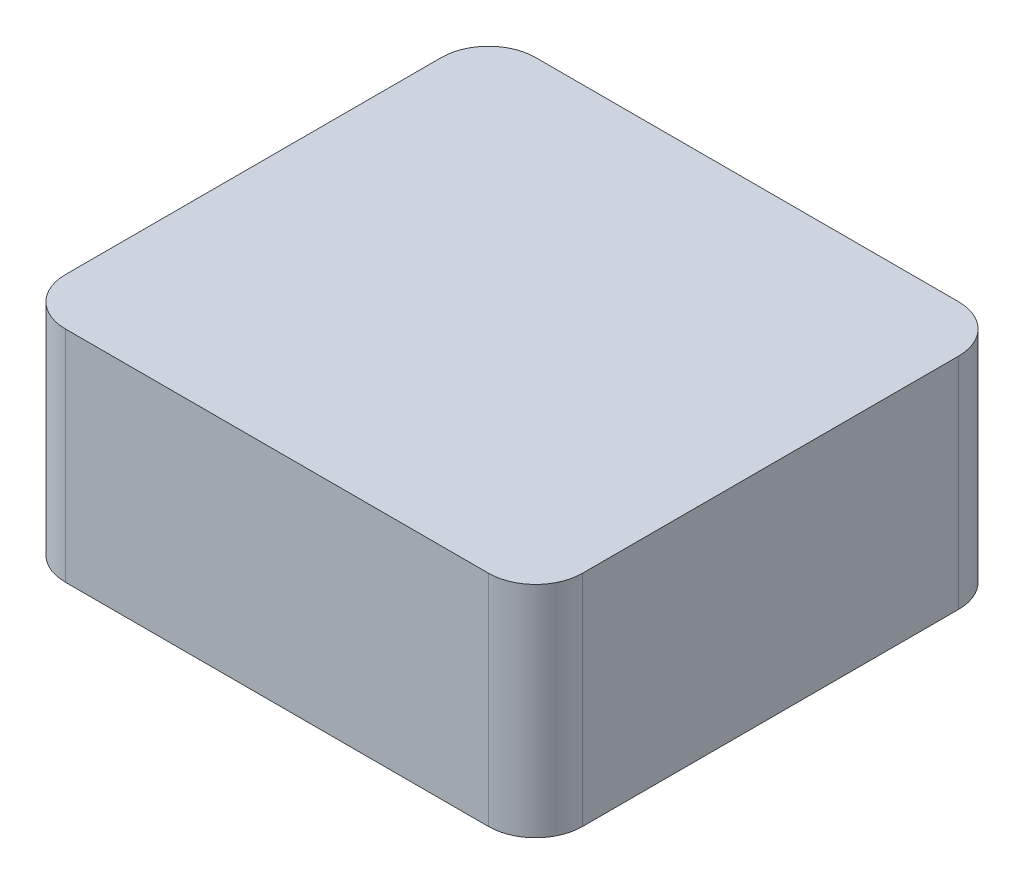
ISO-10303-21;
HEADER;
FILE_DESCRIPTION(('STEP AP214'),'2;1');
FILE_NAME('part.step','',(''),(''),'','','');
FILE_SCHEMA(('AUTOMOTIVE_DESIGN { 1 0 10303 214 1 1 1 1 }'));
ENDSEC;
DATA;
#1=APPLICATION_CONTEXT('core data for automotive mechanical design processes');
#2=APPLICATION_PROTOCOL_DEFINITION('international standard','automotive_design',2000,#1);
#3=PRODUCT_CONTEXT('',#1,'mechanical');
#4=PRODUCT('Part','Part','',(#3));
#5=PRODUCT_RELATED_PRODUCT_CATEGORY('part','',(#4));
#6=PRODUCT_DEFINITION_FORMATION('','',#4);
#7=PRODUCT_DEFINITION_CONTEXT('part definition',#1,'design');
#8=PRODUCT_DEFINITION('design','',#6,#7);
#9=PRODUCT_DEFINITION_SHAPE('','',#8);
#10=(LENGTH_UNIT() NAMED_UNIT(*) SI_UNIT(.MILLI.,.METRE.));
#11=(NAMED_UNIT(*) PLANE_ANGLE_UNIT() SI_UNIT($,.RADIAN.));
#12=(NAMED_UNIT(*) SI_UNIT($,.STERADIAN.) SOLID_ANGLE_UNIT());
#13=UNCERTAINTY_MEASURE_WITH_UNIT(LENGTH_MEASURE(1.E-05),#10,'distance_accuracy_value','');
#14=(GEOMETRIC_REPRESENTATION_CONTEXT(3) GLOBAL_UNCERTAINTY_ASSIGNED_CONTEXT((#13)) GLOBAL_UNIT_ASSIGNED_CONTEXT((#10,
#11,#12)) REPRESENTATION_CONTEXT('',''));
#15=CARTESIAN_POINT('',(0.,0.,0.));
#16=DIRECTION('',(0.,0.,1.));
#17=DIRECTION('',(1.,0.,0.));
#18=AXIS2_PLACEMENT_3D('',#15,#16,#17);
#19=CARTESIAN_POINT('',(-16.5,-7.,-15.));
#20=DIRECTION('',(-1.,0.,0.));
#21=DIRECTION('',(0.,0.,1.));
#22=AXIS2_PLACEMENT_3D('',#19,#20,#21);
#23=PLANE('',#22);
#24=DIRECTION('',(0.,0.,1.));
#25=VECTOR('',#24,1.);
#26=CARTESIAN_POINT('',(-16.5,7.,-15.));
#27=LINE('',#26,#25);
#28=CARTESIAN_POINT('',(-16.5,7.,-12.));
#29=VERTEX_POINT('',#28);
#30=CARTESIAN_POINT('',(-16.5,7.,12.));
#31=VERTEX_POINT('',#30);
#32=EDGE_CURVE('E163',#29,#31,#27,.T.);
#33=ORIENTED_EDGE('',*,*,#32,.F.);
#34=DIRECTION('',(0.,1.,0.));
#35=VECTOR('',#34,1.);
#36=CARTESIAN_POINT('',(-16.5,-7.,-12.));
#37=LINE('',#36,#35);
#38=CARTESIAN_POINT('',(-16.5,-7.,-12.));
#39=VERTEX_POINT('',#38);
#40=EDGE_CURVE('E139',#29,#39,#37,.F.);
#41=ORIENTED_EDGE('',*,*,#40,.T.);
#42=DIRECTION('',(0.,0.,1.));
#43=VECTOR('',#42,1.);
#44=CARTESIAN_POINT('',(-16.5,-7.,-15.));
#45=LINE('',#44,#43);
#46=CARTESIAN_POINT('',(-16.5,-7.,12.));
#47=VERTEX_POINT('',#46);
#48=EDGE_CURVE('E120',#39,#47,#45,.T.);
#49=ORIENTED_EDGE('',*,*,#48,.T.);
#50=DIRECTION('',(0.,1.,0.));
#51=VECTOR('',#50,1.);
#52=CARTESIAN_POINT('',(-16.5,-7.,12.));
#53=LINE('',#52,#51);
#54=EDGE_CURVE('E136',#47,#31,#53,.T.);
#55=ORIENTED_EDGE('',*,*,#54,.T.);
#56=EDGE_LOOP('',(#33,#41,#49,#55));
#57=FACE_BOUND('',#56,.T.);
#58=ADVANCED_FACE('F33',(#57),#23,.T.);
#59=CARTESIAN_POINT('',(-16.5,-7.,-15.));
#60=DIRECTION('',(0.,0.,-1.));
#61=DIRECTION('',(-1.,0.,0.));
#62=AXIS2_PLACEMENT_3D('',#59,#60,#61);
#63=PLANE('',#62);
#64=DIRECTION('',(-1.,0.,0.));
#65=VECTOR('',#64,1.);
#66=CARTESIAN_POINT('',(-16.5,-7.,-15.));
#67=LINE('',#66,#65);
#68=CARTESIAN_POINT('',(13.5,-7.,-15.));
#69=VERTEX_POINT('',#68);
#70=CARTESIAN_POINT('',(-13.5,-7.,-15.));
#71=VERTEX_POINT('',#70);
#72=EDGE_CURVE('E125',#69,#71,#67,.T.);
#73=ORIENTED_EDGE('',*,*,#72,.T.);
#74=DIRECTION('',(0.,1.,0.));
#75=VECTOR('',#74,1.);
#76=CARTESIAN_POINT('',(-13.5,-7.,-15.));
#77=LINE('',#76,#75);
#78=CARTESIAN_POINT('',(-13.5,7.,-15.));
#79=VERTEX_POINT('',#78);
#80=EDGE_CURVE('E119',#71,#79,#77,.T.);
#81=ORIENTED_EDGE('',*,*,#80,.T.);
#82=DIRECTION('',(-1.,0.,0.));
#83=VECTOR('',#82,1.);
#84=CARTESIAN_POINT('',(-16.5,7.,-15.));
#85=LINE('',#84,#83);
#86=CARTESIAN_POINT('',(13.5,7.,-15.));
#87=VERTEX_POINT('',#86);
#88=EDGE_CURVE('E102',#87,#79,#85,.T.);
#89=ORIENTED_EDGE('',*,*,#88,.F.);
#90=DIRECTION('',(0.,1.,0.));
#91=VECTOR('',#90,1.);
#92=CARTESIAN_POINT('',(13.5,-7.,-15.));
#93=LINE('',#92,#91);
#94=EDGE_CURVE('E116',#87,#69,#93,.F.);
#95=ORIENTED_EDGE('',*,*,#94,.T.);
#96=EDGE_LOOP('',(#73,#81,#89,#95));
#97=FACE_BOUND('',#96,.T.);
#98=ADVANCED_FACE('F115',(#97),#63,.T.);
#99=CARTESIAN_POINT('',(16.5,-7.,-15.));
#100=DIRECTION('',(1.,0.,0.));
#101=DIRECTION('',(0.,0.,-1.));
#102=AXIS2_PLACEMENT_3D('',#99,#100,#101);
#103=PLANE('',#102);
#104=DIRECTION('',(0.,0.,-1.));
#105=VECTOR('',#104,1.);
#106=CARTESIAN_POINT('',(16.5,-7.,-15.));
#107=LINE('',#106,#105);
#108=CARTESIAN_POINT('',(16.5,-7.,12.));
#109=VERTEX_POINT('',#108);
#110=CARTESIAN_POINT('',(16.5,-7.,-12.));
#111=VERTEX_POINT('',#110);
#112=EDGE_CURVE('E129',#109,#111,#107,.T.);
#113=ORIENTED_EDGE('',*,*,#112,.T.);
#114=DIRECTION('',(0.,1.,0.));
#115=VECTOR('',#114,1.);
#116=CARTESIAN_POINT('',(16.5,-7.,-12.));
#117=LINE('',#116,#115);
#118=CARTESIAN_POINT('',(16.5,7.,-12.));
#119=VERTEX_POINT('',#118);
#120=EDGE_CURVE('E149',#111,#119,#117,.T.);
#121=ORIENTED_EDGE('',*,*,#120,.T.);
#122=DIRECTION('',(0.,0.,-1.));
#123=VECTOR('',#122,1.);
#124=CARTESIAN_POINT('',(16.5,7.,-15.));
#125=LINE('',#124,#123);
#126=CARTESIAN_POINT('',(16.5,7.,12.));
#127=VERTEX_POINT('',#126);
#128=EDGE_CURVE('E104',#127,#119,#125,.T.);
#129=ORIENTED_EDGE('',*,*,#128,.F.);
#130=DIRECTION('',(0.,1.,0.));
#131=VECTOR('',#130,1.);
#132=CARTESIAN_POINT('',(16.5,-7.,12.));
#133=LINE('',#132,#131);
#134=EDGE_CURVE('E147',#127,#109,#133,.F.);
#135=ORIENTED_EDGE('',*,*,#134,.T.);
#136=EDGE_LOOP('',(#113,#121,#129,#135));
#137=FACE_BOUND('',#136,.T.);
#138=ADVANCED_FACE('F152',(#137),#103,.T.);
#139=CARTESIAN_POINT('',(-16.5,-7.,15.));
#140=DIRECTION('',(0.,0.,1.));
#141=DIRECTION('',(1.,0.,0.));
#142=AXIS2_PLACEMENT_3D('',#139,#140,#141);
#143=PLANE('',#142);
#144=DIRECTION('',(1.,0.,0.));
#145=VECTOR('',#144,1.);
#146=CARTESIAN_POINT('',(-16.5,-7.,15.));
#147=LINE('',#146,#145);
#148=CARTESIAN_POINT('',(-13.5,-7.,15.));
#149=VERTEX_POINT('',#148);
#150=CARTESIAN_POINT('',(13.5,-7.,15.));
#151=VERTEX_POINT('',#150);
#152=EDGE_CURVE('E154',#149,#151,#147,.T.);
#153=ORIENTED_EDGE('',*,*,#152,.T.);
#154=DIRECTION('',(0.,1.,0.));
#155=VECTOR('',#154,1.);
#156=CARTESIAN_POINT('',(13.5,-7.,15.));
#157=LINE('',#156,#155);
#158=CARTESIAN_POINT('',(13.5,7.,15.));
#159=VERTEX_POINT('',#158);
#160=EDGE_CURVE('E11',#151,#159,#157,.T.);
#161=ORIENTED_EDGE('',*,*,#160,.T.);
#162=DIRECTION('',(1.,0.,0.));
#163=VECTOR('',#162,1.);
#164=CARTESIAN_POINT('',(-16.5,7.,15.));
#165=LINE('',#164,#163);
#166=CARTESIAN_POINT('',(-13.5,7.,15.));
#167=VERTEX_POINT('',#166);
#168=EDGE_CURVE('E160',#167,#159,#165,.T.);
#169=ORIENTED_EDGE('',*,*,#168,.F.);
#170=DIRECTION('',(0.,1.,0.));
#171=VECTOR('',#170,1.);
#172=CARTESIAN_POINT('',(-13.5,-7.,15.));
#173=LINE('',#172,#171);
#174=EDGE_CURVE('E41',#167,#149,#173,.F.);
#175=ORIENTED_EDGE('',*,*,#174,.T.);
#176=EDGE_LOOP('',(#153,#161,#169,#175));
#177=FACE_BOUND('',#176,.T.);
#178=ADVANCED_FACE('F190',(#177),#143,.T.);
#179=CARTESIAN_POINT('',(0.,-7.,0.));
#180=DIRECTION('',(0.,1.,0.));
#181=DIRECTION('',(0.,0.,1.));
#182=AXIS2_PLACEMENT_3D('',#179,#180,#181);
#183=PLANE('',#182);
#184=ORIENTED_EDGE('',*,*,#48,.F.);
#185=CARTESIAN_POINT('',(-13.5,-7.,-12.));
#186=DIRECTION('',(0.,1.,0.));
#187=DIRECTION('',(0.,0.,1.));
#188=AXIS2_PLACEMENT_3D('',#185,#186,#187);
#189=CIRCLE('',#188,3.);
#190=EDGE_CURVE('E145',#39,#71,#189,.F.);
#191=ORIENTED_EDGE('',*,*,#190,.T.);
#192=ORIENTED_EDGE('',*,*,#72,.F.);
#193=CARTESIAN_POINT('',(13.5,-7.,-12.));
#194=DIRECTION('',(0.,1.,0.));
#195=DIRECTION('',(0.,0.,1.));
#196=AXIS2_PLACEMENT_3D('',#193,#194,#195);
#197=CIRCLE('',#196,3.);
#198=EDGE_CURVE('E124',#69,#111,#197,.F.);
#199=ORIENTED_EDGE('',*,*,#198,.T.);
#200=ORIENTED_EDGE('',*,*,#112,.F.);
#201=CARTESIAN_POINT('',(13.5,-7.,12.));
#202=DIRECTION('',(0.,1.,0.));
#203=DIRECTION('',(0.,0.,1.));
#204=AXIS2_PLACEMENT_3D('',#201,#202,#203);
#205=CIRCLE('',#204,3.);
#206=EDGE_CURVE('E48',#109,#151,#205,.F.);
#207=ORIENTED_EDGE('',*,*,#206,.T.);
#208=ORIENTED_EDGE('',*,*,#152,.F.);
#209=CARTESIAN_POINT('',(-13.5,-7.,12.));
#210=DIRECTION('',(0.,1.,0.));
#211=DIRECTION('',(0.,0.,1.));
#212=AXIS2_PLACEMENT_3D('',#209,#210,#211);
#213=CIRCLE('',#212,3.);
#214=EDGE_CURVE('E141',#149,#47,#213,.F.);
#215=ORIENTED_EDGE('',*,*,#214,.T.);
#216=EDGE_LOOP('',(#184,#191,#192,#199,#200,#207,#208,#215));
#217=FACE_BOUND('',#216,.T.);
#218=ADVANCED_FACE('F173',(#217),#183,.F.);
#219=CARTESIAN_POINT('',(0.,7.,0.));
#220=DIRECTION('',(0.,1.,0.));
#221=DIRECTION('',(0.,0.,1.));
#222=AXIS2_PLACEMENT_3D('',#219,#220,#221);
#223=PLANE('',#222);
#224=ORIENTED_EDGE('',*,*,#88,.T.);
#225=CARTESIAN_POINT('',(-13.5,7.,-12.));
#226=DIRECTION('',(0.,1.,0.));
#227=DIRECTION('',(0.,0.,1.));
#228=AXIS2_PLACEMENT_3D('',#225,#226,#227);
#229=CIRCLE('',#228,3.);
#230=EDGE_CURVE('E109',#79,#29,#229,.T.);
#231=ORIENTED_EDGE('',*,*,#230,.T.);
#232=ORIENTED_EDGE('',*,*,#32,.T.);
#233=CARTESIAN_POINT('',(-13.5,7.,12.));
#234=DIRECTION('',(0.,1.,0.));
#235=DIRECTION('',(0.,0.,1.));
#236=AXIS2_PLACEMENT_3D('',#233,#234,#235);
#237=CIRCLE('',#236,3.);
#238=EDGE_CURVE('E127',#31,#167,#237,.T.);
#239=ORIENTED_EDGE('',*,*,#238,.T.);
#240=ORIENTED_EDGE('',*,*,#168,.T.);
#241=CARTESIAN_POINT('',(13.5,7.,12.));
#242=DIRECTION('',(0.,1.,0.));
#243=DIRECTION('',(0.,0.,1.));
#244=AXIS2_PLACEMENT_3D('',#241,#242,#243);
#245=CIRCLE('',#244,3.);
#246=EDGE_CURVE('E110',#159,#127,#245,.T.);
#247=ORIENTED_EDGE('',*,*,#246,.T.);
#248=ORIENTED_EDGE('',*,*,#128,.T.);
#249=CARTESIAN_POINT('',(13.5,7.,-12.));
#250=DIRECTION('',(0.,1.,0.));
#251=DIRECTION('',(0.,0.,1.));
#252=AXIS2_PLACEMENT_3D('',#249,#250,#251);
#253=CIRCLE('',#252,3.);
#254=EDGE_CURVE('E99',#119,#87,#253,.T.);
#255=ORIENTED_EDGE('',*,*,#254,.T.);
#256=EDGE_LOOP('',(#224,#231,#232,#239,#240,#247,#248,#255));
#257=FACE_BOUND('',#256,.T.);
#258=ADVANCED_FACE('F101',(#257),#223,.T.);
#259=CARTESIAN_POINT('',(-13.5,-7.,-12.));
#260=DIRECTION('',(0.,1.,0.));
#261=DIRECTION('',(0.,0.,1.));
#262=AXIS2_PLACEMENT_3D('',#259,#260,#261);
#263=CYLINDRICAL_SURFACE('',#262,3.);
#264=ORIENTED_EDGE('',*,*,#190,.F.);
#265=ORIENTED_EDGE('',*,*,#40,.F.);
#266=ORIENTED_EDGE('',*,*,#230,.F.);
#267=ORIENTED_EDGE('',*,*,#80,.F.);
#268=EDGE_LOOP('',(#264,#265,#266,#267));
#269=FACE_BOUND('',#268,.T.);
#270=ADVANCED_FACE('F172',(#269),#263,.T.);
#271=CARTESIAN_POINT('',(13.5,-7.,-12.));
#272=DIRECTION('',(0.,1.,0.));
#273=DIRECTION('',(0.,0.,1.));
#274=AXIS2_PLACEMENT_3D('',#271,#272,#273);
#275=CYLINDRICAL_SURFACE('',#274,3.);
#276=ORIENTED_EDGE('',*,*,#198,.F.);
#277=ORIENTED_EDGE('',*,*,#94,.F.);
#278=ORIENTED_EDGE('',*,*,#254,.F.);
#279=ORIENTED_EDGE('',*,*,#120,.F.);
#280=EDGE_LOOP('',(#276,#277,#278,#279));
#281=FACE_BOUND('',#280,.T.);
#282=ADVANCED_FACE('F123',(#281),#275,.T.);
#283=CARTESIAN_POINT('',(13.5,-7.,12.));
#284=DIRECTION('',(0.,1.,0.));
#285=DIRECTION('',(0.,0.,1.));
#286=AXIS2_PLACEMENT_3D('',#283,#284,#285);
#287=CYLINDRICAL_SURFACE('',#286,3.);
#288=ORIENTED_EDGE('',*,*,#206,.F.);
#289=ORIENTED_EDGE('',*,*,#134,.F.);
#290=ORIENTED_EDGE('',*,*,#246,.F.);
#291=ORIENTED_EDGE('',*,*,#160,.F.);
#292=EDGE_LOOP('',(#288,#289,#290,#291));
#293=FACE_BOUND('',#292,.T.);
#294=ADVANCED_FACE('F177',(#293),#287,.T.);
#295=CARTESIAN_POINT('',(-13.5,-7.,12.));
#296=DIRECTION('',(0.,1.,0.));
#297=DIRECTION('',(0.,0.,1.));
#298=AXIS2_PLACEMENT_3D('',#295,#296,#297);
#299=CYLINDRICAL_SURFACE('',#298,3.);
#300=ORIENTED_EDGE('',*,*,#214,.F.);
#301=ORIENTED_EDGE('',*,*,#174,.F.);
#302=ORIENTED_EDGE('',*,*,#238,.F.);
#303=ORIENTED_EDGE('',*,*,#54,.F.);
#304=EDGE_LOOP('',(#300,#301,#302,#303));
#305=FACE_BOUND('',#304,.T.);
#306=ADVANCED_FACE('F35',(#305),#299,.T.);
#307=CLOSED_SHELL('',(#58,#98,#138,#178,#218,#258,#270,#282,#294,#306));
#308=MANIFOLD_SOLID_BREP('B2',#307);
#309=ADVANCED_BREP_SHAPE_REPRESENTATION('',(#18,#308),#14);
#310=SHAPE_DEFINITION_REPRESENTATION(#9,#309);
ENDSEC;
END-ISO-10303-21;
